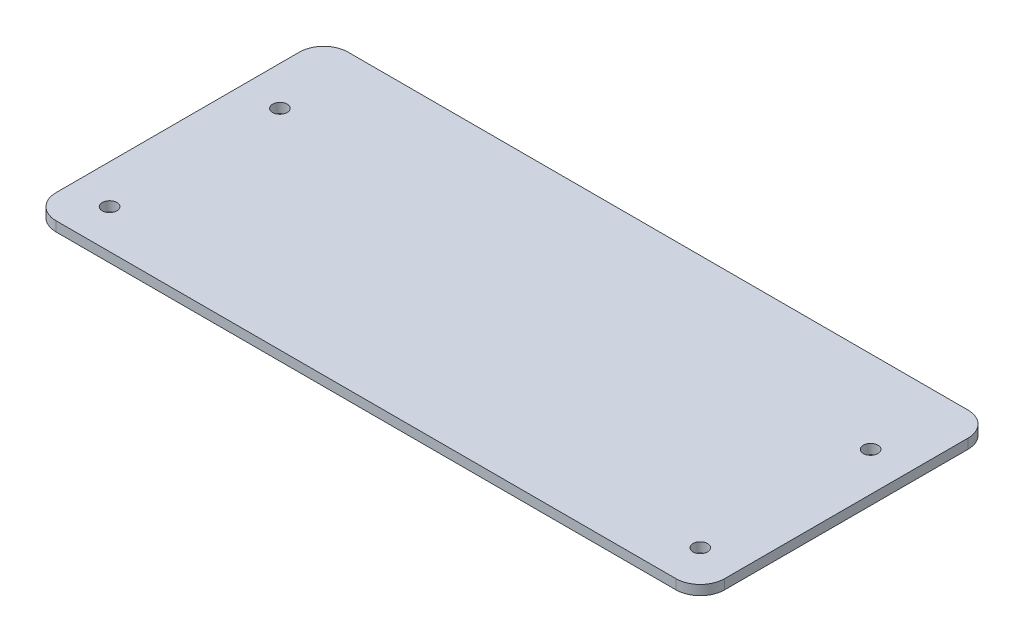
ISO-10303-21;
HEADER;
FILE_DESCRIPTION(('STEP AP214'),'2;1');
FILE_NAME('part.step','',(''),(''),'','','');
FILE_SCHEMA(('AUTOMOTIVE_DESIGN { 1 0 10303 214 1 1 1 1 }'));
ENDSEC;
DATA;
#1=APPLICATION_CONTEXT('core data for automotive mechanical design processes');
#2=APPLICATION_PROTOCOL_DEFINITION('international standard','automotive_design',2000,#1);
#3=PRODUCT_CONTEXT('',#1,'mechanical');
#4=PRODUCT('Part','Part','',(#3));
#5=PRODUCT_RELATED_PRODUCT_CATEGORY('part','',(#4));
#6=PRODUCT_DEFINITION_FORMATION('','',#4);
#7=PRODUCT_DEFINITION_CONTEXT('part definition',#1,'design');
#8=PRODUCT_DEFINITION('design','',#6,#7);
#9=PRODUCT_DEFINITION_SHAPE('','',#8);
#10=(LENGTH_UNIT() NAMED_UNIT(*) SI_UNIT(.MILLI.,.METRE.));
#11=(NAMED_UNIT(*) PLANE_ANGLE_UNIT() SI_UNIT($,.RADIAN.));
#12=(NAMED_UNIT(*) SI_UNIT($,.STERADIAN.) SOLID_ANGLE_UNIT());
#13=UNCERTAINTY_MEASURE_WITH_UNIT(LENGTH_MEASURE(1.E-05),#10,'distance_accuracy_value','');
#14=(GEOMETRIC_REPRESENTATION_CONTEXT(3) GLOBAL_UNCERTAINTY_ASSIGNED_CONTEXT((#13)) GLOBAL_UNIT_ASSIGNED_CONTEXT((#10,
#11,#12)) REPRESENTATION_CONTEXT('',''));
#15=CARTESIAN_POINT('',(0.,0.,0.));
#16=DIRECTION('',(0.,0.,1.));
#17=DIRECTION('',(1.,0.,0.));
#18=AXIS2_PLACEMENT_3D('',#15,#16,#17);
#19=CARTESIAN_POINT('',(-687.300884955741,2.,-57.6442477876105));
#20=DIRECTION('',(0.,-1.,0.));
#21=DIRECTION('',(0.,0.,-1.));
#22=AXIS2_PLACEMENT_3D('',#19,#20,#21);
#23=CYLINDRICAL_SURFACE('',#22,5.);
#24=CARTESIAN_POINT('',(-687.300884955741,0.,-57.6442477876105));
#25=DIRECTION('',(0.,1.,0.));
#26=DIRECTION('',(0.,0.,1.));
#27=AXIS2_PLACEMENT_3D('',#24,#25,#26);
#28=CIRCLE('',#27,5.);
#29=CARTESIAN_POINT('',(-682.300884955741,0.,-57.6442477876105));
#30=VERTEX_POINT('',#29);
#31=CARTESIAN_POINT('',(-687.300884955741,0.,-62.6442477876105));
#32=VERTEX_POINT('',#31);
#33=EDGE_CURVE('E131',#30,#32,#28,.T.);
#34=ORIENTED_EDGE('',*,*,#33,.T.);
#35=DIRECTION('',(0.,-1.,0.));
#36=VECTOR('',#35,1.);
#37=CARTESIAN_POINT('',(-687.300884955741,2.,-62.6442477876105));
#38=LINE('',#37,#36);
#39=CARTESIAN_POINT('',(-687.300884955741,2.,-62.6442477876105));
#40=VERTEX_POINT('',#39);
#41=EDGE_CURVE('E11',#40,#32,#38,.T.);
#42=ORIENTED_EDGE('',*,*,#41,.F.);
#43=CARTESIAN_POINT('',(-687.300884955741,2.,-57.6442477876105));
#44=DIRECTION('',(0.,1.,0.));
#45=DIRECTION('',(0.,0.,1.));
#46=AXIS2_PLACEMENT_3D('',#43,#44,#45);
#47=CIRCLE('',#46,5.);
#48=CARTESIAN_POINT('',(-682.300884955741,2.,-57.6442477876105));
#49=VERTEX_POINT('',#48);
#50=EDGE_CURVE('E146',#49,#40,#47,.T.);
#51=ORIENTED_EDGE('',*,*,#50,.F.);
#52=DIRECTION('',(0.,-1.,0.));
#53=VECTOR('',#52,1.);
#54=CARTESIAN_POINT('',(-682.300884955741,2.,-57.6442477876105));
#55=LINE('',#54,#53);
#56=EDGE_CURVE('E127',#49,#30,#55,.T.);
#57=ORIENTED_EDGE('',*,*,#56,.T.);
#58=EDGE_LOOP('',(#34,#42,#51,#57));
#59=FACE_BOUND('',#58,.T.);
#60=ADVANCED_FACE('F35',(#59),#23,.T.);
#61=CARTESIAN_POINT('',(-687.300884955741,2.,-62.6442477876105));
#62=DIRECTION('',(0.,0.,1.));
#63=DIRECTION('',(1.,0.,0.));
#64=AXIS2_PLACEMENT_3D('',#61,#62,#63);
#65=PLANE('',#64);
#66=DIRECTION('',(-1.,0.,0.));
#67=VECTOR('',#66,1.);
#68=CARTESIAN_POINT('',(-687.300884955741,0.,-62.6442477876105));
#69=LINE('',#68,#67);
#70=CARTESIAN_POINT('',(-814.660884955741,0.,-62.6442477876105));
#71=VERTEX_POINT('',#70);
#72=EDGE_CURVE('E134',#32,#71,#69,.T.);
#73=ORIENTED_EDGE('',*,*,#72,.T.);
#74=DIRECTION('',(0.,-1.,0.));
#75=VECTOR('',#74,1.);
#76=CARTESIAN_POINT('',(-814.660884955741,2.,-62.6442477876105));
#77=LINE('',#76,#75);
#78=CARTESIAN_POINT('',(-814.660884955741,2.,-62.6442477876105));
#79=VERTEX_POINT('',#78);
#80=EDGE_CURVE('E43',#79,#71,#77,.T.);
#81=ORIENTED_EDGE('',*,*,#80,.F.);
#82=DIRECTION('',(-1.,0.,0.));
#83=VECTOR('',#82,1.);
#84=CARTESIAN_POINT('',(-687.300884955741,2.,-62.6442477876105));
#85=LINE('',#84,#83);
#86=EDGE_CURVE('E94',#40,#79,#85,.T.);
#87=ORIENTED_EDGE('',*,*,#86,.F.);
#88=ORIENTED_EDGE('',*,*,#41,.T.);
#89=EDGE_LOOP('',(#73,#81,#87,#88));
#90=FACE_BOUND('',#89,.T.);
#91=ADVANCED_FACE('F234',(#90),#65,.F.);
#92=CARTESIAN_POINT('',(-814.660884955741,2.,-57.6442477876105));
#93=DIRECTION('',(0.,-1.,0.));
#94=DIRECTION('',(0.,0.,-1.));
#95=AXIS2_PLACEMENT_3D('',#92,#93,#94);
#96=CYLINDRICAL_SURFACE('',#95,5.);
#97=CARTESIAN_POINT('',(-814.660884955741,0.,-57.6442477876105));
#98=DIRECTION('',(0.,1.,0.));
#99=DIRECTION('',(0.,0.,-1.));
#100=AXIS2_PLACEMENT_3D('',#97,#98,#99);
#101=CIRCLE('',#100,5.);
#102=CARTESIAN_POINT('',(-819.660884955741,0.,-57.6442477876105));
#103=VERTEX_POINT('',#102);
#104=EDGE_CURVE('E137',#71,#103,#101,.T.);
#105=ORIENTED_EDGE('',*,*,#104,.T.);
#106=DIRECTION('',(0.,-1.,0.));
#107=VECTOR('',#106,1.);
#108=CARTESIAN_POINT('',(-819.660884955741,2.,-57.6442477876105));
#109=LINE('',#108,#107);
#110=CARTESIAN_POINT('',(-819.660884955741,2.,-57.6442477876105));
#111=VERTEX_POINT('',#110);
#112=EDGE_CURVE('E153',#111,#103,#109,.T.);
#113=ORIENTED_EDGE('',*,*,#112,.F.);
#114=CARTESIAN_POINT('',(-814.660884955741,2.,-57.6442477876105));
#115=DIRECTION('',(0.,1.,0.));
#116=DIRECTION('',(0.,0.,-1.));
#117=AXIS2_PLACEMENT_3D('',#114,#115,#116);
#118=CIRCLE('',#117,5.);
#119=EDGE_CURVE('E161',#79,#111,#118,.T.);
#120=ORIENTED_EDGE('',*,*,#119,.F.);
#121=ORIENTED_EDGE('',*,*,#80,.T.);
#122=EDGE_LOOP('',(#105,#113,#120,#121));
#123=FACE_BOUND('',#122,.T.);
#124=ADVANCED_FACE('F159',(#123),#96,.T.);
#125=CARTESIAN_POINT('',(-819.660884955741,2.,-57.6442477876105));
#126=DIRECTION('',(1.,0.,0.));
#127=DIRECTION('',(0.,0.,-1.));
#128=AXIS2_PLACEMENT_3D('',#125,#126,#127);
#129=PLANE('',#128);
#130=DIRECTION('',(0.,0.,1.));
#131=VECTOR('',#130,1.);
#132=CARTESIAN_POINT('',(-819.660884955741,0.,-57.6442477876105));
#133=LINE('',#132,#131);
#134=CARTESIAN_POINT('',(-819.660884955741,0.,-7.64424778761054));
#135=VERTEX_POINT('',#134);
#136=EDGE_CURVE('E139',#103,#135,#133,.T.);
#137=ORIENTED_EDGE('',*,*,#136,.T.);
#138=DIRECTION('',(0.,-1.,0.));
#139=VECTOR('',#138,1.);
#140=CARTESIAN_POINT('',(-819.660884955741,2.,-7.64424778761054));
#141=LINE('',#140,#139);
#142=CARTESIAN_POINT('',(-819.660884955741,2.,-7.64424778761054));
#143=VERTEX_POINT('',#142);
#144=EDGE_CURVE('E150',#143,#135,#141,.T.);
#145=ORIENTED_EDGE('',*,*,#144,.F.);
#146=DIRECTION('',(0.,0.,1.));
#147=VECTOR('',#146,1.);
#148=CARTESIAN_POINT('',(-819.660884955741,2.,-57.6442477876105));
#149=LINE('',#148,#147);
#150=EDGE_CURVE('E173',#111,#143,#149,.T.);
#151=ORIENTED_EDGE('',*,*,#150,.F.);
#152=ORIENTED_EDGE('',*,*,#112,.T.);
#153=EDGE_LOOP('',(#137,#145,#151,#152));
#154=FACE_BOUND('',#153,.T.);
#155=ADVANCED_FACE('F169',(#154),#129,.F.);
#156=CARTESIAN_POINT('',(-814.660884955741,2.,-7.64424778761054));
#157=DIRECTION('',(0.,-1.,0.));
#158=DIRECTION('',(0.,0.,-1.));
#159=AXIS2_PLACEMENT_3D('',#156,#157,#158);
#160=CYLINDRICAL_SURFACE('',#159,5.);
#161=CARTESIAN_POINT('',(-814.660884955741,0.,-7.64424778761054));
#162=DIRECTION('',(0.,1.,0.));
#163=DIRECTION('',(0.,0.,-1.));
#164=AXIS2_PLACEMENT_3D('',#161,#162,#163);
#165=CIRCLE('',#164,5.);
#166=CARTESIAN_POINT('',(-814.660884955741,0.,-2.64424778761054));
#167=VERTEX_POINT('',#166);
#168=EDGE_CURVE('E141',#135,#167,#165,.T.);
#169=ORIENTED_EDGE('',*,*,#168,.T.);
#170=DIRECTION('',(0.,-1.,0.));
#171=VECTOR('',#170,1.);
#172=CARTESIAN_POINT('',(-814.660884955741,2.,-2.64424778761054));
#173=LINE('',#172,#171);
#174=CARTESIAN_POINT('',(-814.660884955741,2.,-2.64424778761054));
#175=VERTEX_POINT('',#174);
#176=EDGE_CURVE('E122',#175,#167,#173,.T.);
#177=ORIENTED_EDGE('',*,*,#176,.F.);
#178=CARTESIAN_POINT('',(-814.660884955741,2.,-7.64424778761054));
#179=DIRECTION('',(0.,1.,0.));
#180=DIRECTION('',(0.,0.,-1.));
#181=AXIS2_PLACEMENT_3D('',#178,#179,#180);
#182=CIRCLE('',#181,5.);
#183=EDGE_CURVE('E113',#143,#175,#182,.T.);
#184=ORIENTED_EDGE('',*,*,#183,.F.);
#185=ORIENTED_EDGE('',*,*,#144,.T.);
#186=EDGE_LOOP('',(#169,#177,#184,#185));
#187=FACE_BOUND('',#186,.T.);
#188=ADVANCED_FACE('F172',(#187),#160,.T.);
#189=CARTESIAN_POINT('',(-687.300884955741,2.,-2.64424778761055));
#190=DIRECTION('',(0.,0.,-1.));
#191=DIRECTION('',(-1.,0.,0.));
#192=AXIS2_PLACEMENT_3D('',#189,#190,#191);
#193=PLANE('',#192);
#194=DIRECTION('',(1.,0.,0.));
#195=VECTOR('',#194,1.);
#196=CARTESIAN_POINT('',(-687.300884955741,0.,-2.64424778761055));
#197=LINE('',#196,#195);
#198=CARTESIAN_POINT('',(-687.300884955741,0.,-2.64424778761055));
#199=VERTEX_POINT('',#198);
#200=EDGE_CURVE('E121',#167,#199,#197,.T.);
#201=ORIENTED_EDGE('',*,*,#200,.T.);
#202=DIRECTION('',(0.,-1.,0.));
#203=VECTOR('',#202,1.);
#204=CARTESIAN_POINT('',(-687.300884955741,2.,-2.64424778761055));
#205=LINE('',#204,#203);
#206=CARTESIAN_POINT('',(-687.300884955741,2.,-2.64424778761055));
#207=VERTEX_POINT('',#206);
#208=EDGE_CURVE('E118',#207,#199,#205,.T.);
#209=ORIENTED_EDGE('',*,*,#208,.F.);
#210=DIRECTION('',(1.,0.,0.));
#211=VECTOR('',#210,1.);
#212=CARTESIAN_POINT('',(-687.300884955741,2.,-2.64424778761055));
#213=LINE('',#212,#211);
#214=EDGE_CURVE('E107',#175,#207,#213,.T.);
#215=ORIENTED_EDGE('',*,*,#214,.F.);
#216=ORIENTED_EDGE('',*,*,#176,.T.);
#217=EDGE_LOOP('',(#201,#209,#215,#216));
#218=FACE_BOUND('',#217,.T.);
#219=ADVANCED_FACE('F119',(#218),#193,.F.);
#220=CARTESIAN_POINT('',(-687.300884955741,2.,-7.64424778761055));
#221=DIRECTION('',(0.,-1.,0.));
#222=DIRECTION('',(0.,0.,-1.));
#223=AXIS2_PLACEMENT_3D('',#220,#221,#222);
#224=CYLINDRICAL_SURFACE('',#223,5.);
#225=CARTESIAN_POINT('',(-687.300884955741,0.,-7.64424778761055));
#226=DIRECTION('',(0.,1.,0.));
#227=DIRECTION('',(0.,0.,-1.));
#228=AXIS2_PLACEMENT_3D('',#225,#226,#227);
#229=CIRCLE('',#228,5.);
#230=CARTESIAN_POINT('',(-682.300884955741,0.,-7.64424778761055));
#231=VERTEX_POINT('',#230);
#232=EDGE_CURVE('E80',#199,#231,#229,.T.);
#233=ORIENTED_EDGE('',*,*,#232,.T.);
#234=DIRECTION('',(0.,-1.,0.));
#235=VECTOR('',#234,1.);
#236=CARTESIAN_POINT('',(-682.300884955741,2.,-7.64424778761055));
#237=LINE('',#236,#235);
#238=CARTESIAN_POINT('',(-682.300884955741,2.,-7.64424778761055));
#239=VERTEX_POINT('',#238);
#240=EDGE_CURVE('E123',#239,#231,#237,.T.);
#241=ORIENTED_EDGE('',*,*,#240,.F.);
#242=CARTESIAN_POINT('',(-687.300884955741,2.,-7.64424778761055));
#243=DIRECTION('',(0.,1.,0.));
#244=DIRECTION('',(0.,0.,-1.));
#245=AXIS2_PLACEMENT_3D('',#242,#243,#244);
#246=CIRCLE('',#245,5.);
#247=EDGE_CURVE('E111',#207,#239,#246,.T.);
#248=ORIENTED_EDGE('',*,*,#247,.F.);
#249=ORIENTED_EDGE('',*,*,#208,.T.);
#250=EDGE_LOOP('',(#233,#241,#248,#249));
#251=FACE_BOUND('',#250,.T.);
#252=ADVANCED_FACE('F125',(#251),#224,.T.);
#253=CARTESIAN_POINT('',(-682.300884955741,2.,-57.6442477876105));
#254=DIRECTION('',(-1.,0.,0.));
#255=DIRECTION('',(0.,0.,1.));
#256=AXIS2_PLACEMENT_3D('',#253,#254,#255);
#257=PLANE('',#256);
#258=DIRECTION('',(0.,0.,-1.));
#259=VECTOR('',#258,1.);
#260=CARTESIAN_POINT('',(-682.300884955741,0.,-57.6442477876105));
#261=LINE('',#260,#259);
#262=EDGE_CURVE('E86',#231,#30,#261,.T.);
#263=ORIENTED_EDGE('',*,*,#262,.T.);
#264=ORIENTED_EDGE('',*,*,#56,.F.);
#265=DIRECTION('',(0.,0.,-1.));
#266=VECTOR('',#265,1.);
#267=CARTESIAN_POINT('',(-682.300884955741,2.,-57.6442477876105));
#268=LINE('',#267,#266);
#269=EDGE_CURVE('E51',#239,#49,#268,.T.);
#270=ORIENTED_EDGE('',*,*,#269,.F.);
#271=ORIENTED_EDGE('',*,*,#240,.T.);
#272=EDGE_LOOP('',(#263,#264,#270,#271));
#273=FACE_BOUND('',#272,.T.);
#274=ADVANCED_FACE('F241',(#273),#257,.F.);
#275=CARTESIAN_POINT('',(-687.300884955741,2.,-57.6442477876105));
#276=DIRECTION('',(0.,1.,0.));
#277=DIRECTION('',(0.,0.,1.));
#278=AXIS2_PLACEMENT_3D('',#275,#276,#277);
#279=PLANE('',#278);
#280=CARTESIAN_POINT('',(-690.300884955741,2.,-45.6442477876103));
#281=DIRECTION('',(0.,-1.,0.));
#282=DIRECTION('',(0.,0.,-1.));
#283=AXIS2_PLACEMENT_3D('',#280,#281,#282);
#284=CIRCLE('',#283,1.50000000000287);
#285=CARTESIAN_POINT('',(-690.300884955741,2.,-47.1442477876132));
#286=VERTEX_POINT('',#285);
#287=EDGE_CURVE('E194',#286,#286,#284,.T.);
#288=ORIENTED_EDGE('',*,*,#287,.T.);
#289=EDGE_LOOP('',(#288));
#290=FACE_BOUND('',#289,.T.);
#291=CARTESIAN_POINT('',(-690.300884955741,2.,-10.6442477876104));
#292=DIRECTION('',(0.,-1.,0.));
#293=DIRECTION('',(0.,0.,-1.));
#294=AXIS2_PLACEMENT_3D('',#291,#292,#293);
#295=CIRCLE('',#294,1.50000000000287);
#296=CARTESIAN_POINT('',(-690.300884955741,2.,-12.1442477876132));
#297=VERTEX_POINT('',#296);
#298=EDGE_CURVE('E188',#297,#297,#295,.T.);
#299=ORIENTED_EDGE('',*,*,#298,.T.);
#300=EDGE_LOOP('',(#299));
#301=FACE_BOUND('',#300,.T.);
#302=CARTESIAN_POINT('',(-811.660884955741,2.,-45.6442477876108));
#303=DIRECTION('',(0.,-1.,0.));
#304=DIRECTION('',(0.,0.,-1.));
#305=AXIS2_PLACEMENT_3D('',#302,#303,#304);
#306=CIRCLE('',#305,1.5000000000009);
#307=CARTESIAN_POINT('',(-811.660884955741,2.,-47.1442477876117));
#308=VERTEX_POINT('',#307);
#309=EDGE_CURVE('E182',#308,#308,#306,.T.);
#310=ORIENTED_EDGE('',*,*,#309,.T.);
#311=EDGE_LOOP('',(#310));
#312=FACE_BOUND('',#311,.T.);
#313=CARTESIAN_POINT('',(-811.660884955741,2.,-10.6442477876108));
#314=DIRECTION('',(0.,-1.,0.));
#315=DIRECTION('',(0.,0.,-1.));
#316=AXIS2_PLACEMENT_3D('',#313,#314,#315);
#317=CIRCLE('',#316,1.5000000000009);
#318=CARTESIAN_POINT('',(-811.660884955741,2.,-12.1442477876117));
#319=VERTEX_POINT('',#318);
#320=EDGE_CURVE('E135',#319,#319,#317,.T.);
#321=ORIENTED_EDGE('',*,*,#320,.T.);
#322=EDGE_LOOP('',(#321));
#323=FACE_BOUND('',#322,.T.);
#324=ORIENTED_EDGE('',*,*,#50,.T.);
#325=ORIENTED_EDGE('',*,*,#86,.T.);
#326=ORIENTED_EDGE('',*,*,#119,.T.);
#327=ORIENTED_EDGE('',*,*,#150,.T.);
#328=ORIENTED_EDGE('',*,*,#183,.T.);
#329=ORIENTED_EDGE('',*,*,#214,.T.);
#330=ORIENTED_EDGE('',*,*,#247,.T.);
#331=ORIENTED_EDGE('',*,*,#269,.T.);
#332=EDGE_LOOP('',(#324,#325,#326,#327,#328,#329,#330,#331));
#333=FACE_BOUND('',#332,.T.);
#334=ADVANCED_FACE('F109',(#290,#301,#312,#323,#333),#279,.T.);
#335=CARTESIAN_POINT('',(-687.300884955741,0.,-57.6442477876105));
#336=DIRECTION('',(0.,1.,0.));
#337=DIRECTION('',(0.,0.,1.));
#338=AXIS2_PLACEMENT_3D('',#335,#336,#337);
#339=PLANE('',#338);
#340=CARTESIAN_POINT('',(-690.300884955741,0.,-45.6442477876103));
#341=DIRECTION('',(0.,-1.,0.));
#342=DIRECTION('',(0.,0.,-1.));
#343=AXIS2_PLACEMENT_3D('',#340,#341,#342);
#344=CIRCLE('',#343,1.50000000000287);
#345=CARTESIAN_POINT('',(-690.300884955741,0.,-47.1442477876132));
#346=VERTEX_POINT('',#345);
#347=EDGE_CURVE('E197',#346,#346,#344,.T.);
#348=ORIENTED_EDGE('',*,*,#347,.F.);
#349=EDGE_LOOP('',(#348));
#350=FACE_BOUND('',#349,.T.);
#351=CARTESIAN_POINT('',(-690.300884955741,0.,-10.6442477876104));
#352=DIRECTION('',(0.,-1.,0.));
#353=DIRECTION('',(0.,0.,-1.));
#354=AXIS2_PLACEMENT_3D('',#351,#352,#353);
#355=CIRCLE('',#354,1.50000000000287);
#356=CARTESIAN_POINT('',(-690.300884955741,0.,-12.1442477876132));
#357=VERTEX_POINT('',#356);
#358=EDGE_CURVE('E191',#357,#357,#355,.T.);
#359=ORIENTED_EDGE('',*,*,#358,.F.);
#360=EDGE_LOOP('',(#359));
#361=FACE_BOUND('',#360,.T.);
#362=CARTESIAN_POINT('',(-811.660884955741,0.,-45.6442477876108));
#363=DIRECTION('',(0.,-1.,0.));
#364=DIRECTION('',(0.,0.,-1.));
#365=AXIS2_PLACEMENT_3D('',#362,#363,#364);
#366=CIRCLE('',#365,1.5000000000009);
#367=CARTESIAN_POINT('',(-811.660884955741,0.,-47.1442477876117));
#368=VERTEX_POINT('',#367);
#369=EDGE_CURVE('E185',#368,#368,#366,.T.);
#370=ORIENTED_EDGE('',*,*,#369,.F.);
#371=EDGE_LOOP('',(#370));
#372=FACE_BOUND('',#371,.T.);
#373=CARTESIAN_POINT('',(-811.660884955741,0.,-10.6442477876108));
#374=DIRECTION('',(0.,-1.,0.));
#375=DIRECTION('',(0.,0.,-1.));
#376=AXIS2_PLACEMENT_3D('',#373,#374,#375);
#377=CIRCLE('',#376,1.5000000000009);
#378=CARTESIAN_POINT('',(-811.660884955741,0.,-12.1442477876117));
#379=VERTEX_POINT('',#378);
#380=EDGE_CURVE('E179',#379,#379,#377,.T.);
#381=ORIENTED_EDGE('',*,*,#380,.F.);
#382=EDGE_LOOP('',(#381));
#383=FACE_BOUND('',#382,.T.);
#384=ORIENTED_EDGE('',*,*,#33,.F.);
#385=ORIENTED_EDGE('',*,*,#262,.F.);
#386=ORIENTED_EDGE('',*,*,#232,.F.);
#387=ORIENTED_EDGE('',*,*,#200,.F.);
#388=ORIENTED_EDGE('',*,*,#168,.F.);
#389=ORIENTED_EDGE('',*,*,#136,.F.);
#390=ORIENTED_EDGE('',*,*,#104,.F.);
#391=ORIENTED_EDGE('',*,*,#72,.F.);
#392=EDGE_LOOP('',(#384,#385,#386,#387,#388,#389,#390,#391));
#393=FACE_BOUND('',#392,.T.);
#394=ADVANCED_FACE('F165',(#350,#361,#372,#383,#393),#339,.F.);
#395=CARTESIAN_POINT('',(-811.660884955741,2.,-10.6442477876108));
#396=DIRECTION('',(0.,-1.,0.));
#397=DIRECTION('',(0.,0.,-1.));
#398=AXIS2_PLACEMENT_3D('',#395,#396,#397);
#399=CYLINDRICAL_SURFACE('',#398,1.5000000000009);
#400=ORIENTED_EDGE('',*,*,#320,.F.);
#401=EDGE_LOOP('',(#400));
#402=FACE_BOUND('',#401,.T.);
#403=ORIENTED_EDGE('',*,*,#380,.T.);
#404=EDGE_LOOP('',(#403));
#405=FACE_BOUND('',#404,.T.);
#406=ADVANCED_FACE('F214',(#402,#405),#399,.F.);
#407=CARTESIAN_POINT('',(-811.660884955741,2.,-45.6442477876108));
#408=DIRECTION('',(0.,-1.,0.));
#409=DIRECTION('',(0.,0.,-1.));
#410=AXIS2_PLACEMENT_3D('',#407,#408,#409);
#411=CYLINDRICAL_SURFACE('',#410,1.5000000000009);
#412=ORIENTED_EDGE('',*,*,#309,.F.);
#413=EDGE_LOOP('',(#412));
#414=FACE_BOUND('',#413,.T.);
#415=ORIENTED_EDGE('',*,*,#369,.T.);
#416=EDGE_LOOP('',(#415));
#417=FACE_BOUND('',#416,.T.);
#418=ADVANCED_FACE('F223',(#414,#417),#411,.F.);
#419=CARTESIAN_POINT('',(-690.300884955741,2.,-10.6442477876104));
#420=DIRECTION('',(0.,-1.,0.));
#421=DIRECTION('',(0.,0.,-1.));
#422=AXIS2_PLACEMENT_3D('',#419,#420,#421);
#423=CYLINDRICAL_SURFACE('',#422,1.50000000000287);
#424=ORIENTED_EDGE('',*,*,#298,.F.);
#425=EDGE_LOOP('',(#424));
#426=FACE_BOUND('',#425,.T.);
#427=ORIENTED_EDGE('',*,*,#358,.T.);
#428=EDGE_LOOP('',(#427));
#429=FACE_BOUND('',#428,.T.);
#430=ADVANCED_FACE('F208',(#426,#429),#423,.F.);
#431=CARTESIAN_POINT('',(-690.300884955741,2.,-45.6442477876103));
#432=DIRECTION('',(0.,-1.,0.));
#433=DIRECTION('',(0.,0.,-1.));
#434=AXIS2_PLACEMENT_3D('',#431,#432,#433);
#435=CYLINDRICAL_SURFACE('',#434,1.50000000000287);
#436=ORIENTED_EDGE('',*,*,#287,.F.);
#437=EDGE_LOOP('',(#436));
#438=FACE_BOUND('',#437,.T.);
#439=ORIENTED_EDGE('',*,*,#347,.T.);
#440=EDGE_LOOP('',(#439));
#441=FACE_BOUND('',#440,.T.);
#442=ADVANCED_FACE('F205',(#438,#441),#435,.F.);
#443=CLOSED_SHELL('',(#60,#91,#124,#155,#188,#219,#252,#274,#334,#394,#406,#418,#430,#442));
#444=MANIFOLD_SOLID_BREP('B2',#443);
#445=ADVANCED_BREP_SHAPE_REPRESENTATION('',(#18,#444),#14);
#446=SHAPE_DEFINITION_REPRESENTATION(#9,#445);
ENDSEC;
END-ISO-10303-21;
